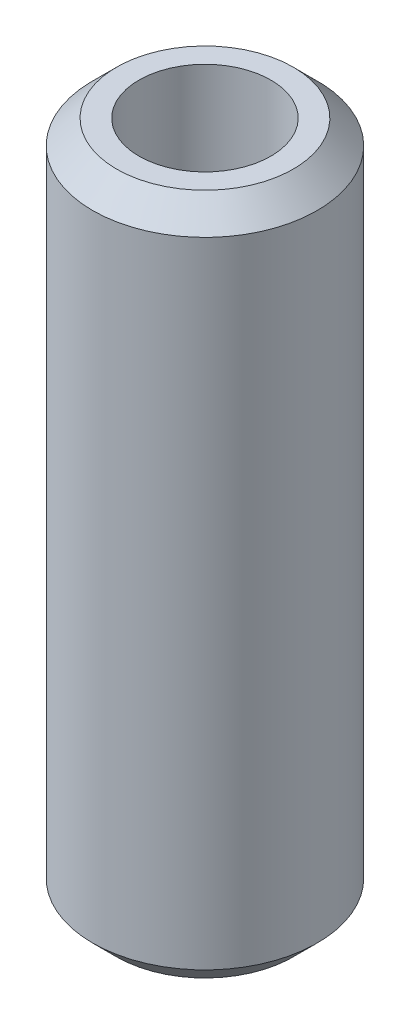
ISO-10303-21;
HEADER;
FILE_DESCRIPTION(('STEP AP214'),'2;1');
FILE_NAME('part.step','',(''),(''),'','','');
FILE_SCHEMA(('AUTOMOTIVE_DESIGN { 1 0 10303 214 1 1 1 1 }'));
ENDSEC;
DATA;
#1=APPLICATION_CONTEXT('core data for automotive mechanical design processes');
#2=APPLICATION_PROTOCOL_DEFINITION('international standard','automotive_design',2000,#1);
#3=PRODUCT_CONTEXT('',#1,'mechanical');
#4=PRODUCT('Part','Part','',(#3));
#5=PRODUCT_RELATED_PRODUCT_CATEGORY('part','',(#4));
#6=PRODUCT_DEFINITION_FORMATION('','',#4);
#7=PRODUCT_DEFINITION_CONTEXT('part definition',#1,'design');
#8=PRODUCT_DEFINITION('design','',#6,#7);
#9=PRODUCT_DEFINITION_SHAPE('','',#8);
#10=(LENGTH_UNIT() NAMED_UNIT(*) SI_UNIT(.MILLI.,.METRE.));
#11=(NAMED_UNIT(*) PLANE_ANGLE_UNIT() SI_UNIT($,.RADIAN.));
#12=(NAMED_UNIT(*) SI_UNIT($,.STERADIAN.) SOLID_ANGLE_UNIT());
#13=UNCERTAINTY_MEASURE_WITH_UNIT(LENGTH_MEASURE(1.E-05),#10,'distance_accuracy_value','');
#14=(GEOMETRIC_REPRESENTATION_CONTEXT(3) GLOBAL_UNCERTAINTY_ASSIGNED_CONTEXT((#13)) GLOBAL_UNIT_ASSIGNED_CONTEXT((#10,
#11,#12)) REPRESENTATION_CONTEXT('',''));
#15=CARTESIAN_POINT('',(0.,0.,0.));
#16=DIRECTION('',(0.,0.,1.));
#17=DIRECTION('',(1.,0.,0.));
#18=AXIS2_PLACEMENT_3D('',#15,#16,#17);
#19=CARTESIAN_POINT('',(0.,45.5729119586695,0.));
#20=DIRECTION('',(0.,-1.,0.));
#21=DIRECTION('',(0.,0.,-1.));
#22=AXIS2_PLACEMENT_3D('',#19,#20,#21);
#23=CYLINDRICAL_SURFACE('',#22,7.5);
#24=CARTESIAN_POINT('',(0.,43.9753235145406,0.));
#25=DIRECTION('',(0.,1.,0.));
#26=DIRECTION('',(0.,0.,1.));
#27=AXIS2_PLACEMENT_3D('',#24,#25,#26);
#28=CIRCLE('',#27,7.5);
#29=CARTESIAN_POINT('',(0.,43.9753235145406,7.5));
#30=VERTEX_POINT('',#29);
#31=EDGE_CURVE('E50',#30,#30,#28,.F.);
#32=ORIENTED_EDGE('',*,*,#31,.T.);
#33=EDGE_LOOP('',(#32));
#34=FACE_BOUND('',#33,.T.);
#35=CARTESIAN_POINT('',(0.,1.59758844412891,0.));
#36=DIRECTION('',(0.,1.,0.));
#37=DIRECTION('',(0.,0.,1.));
#38=AXIS2_PLACEMENT_3D('',#35,#36,#37);
#39=CIRCLE('',#38,7.5);
#40=CARTESIAN_POINT('',(0.,1.59758844412891,7.5));
#41=VERTEX_POINT('',#40);
#42=EDGE_CURVE('E51',#41,#41,#39,.T.);
#43=ORIENTED_EDGE('',*,*,#42,.T.);
#44=EDGE_LOOP('',(#43));
#45=FACE_BOUND('',#44,.T.);
#46=ADVANCED_FACE('F39',(#34,#45),#23,.T.);
#47=CARTESIAN_POINT('',(0.,45.5729119586695,0.));
#48=DIRECTION('',(0.,1.,0.));
#49=DIRECTION('',(0.,0.,1.));
#50=AXIS2_PLACEMENT_3D('',#47,#48,#49);
#51=PLANE('',#50);
#52=CARTESIAN_POINT('',(0.,45.5729119586695,0.));
#53=DIRECTION('',(0.,1.,0.));
#54=DIRECTION('',(0.,0.,1.));
#55=AXIS2_PLACEMENT_3D('',#52,#53,#54);
#56=CIRCLE('',#55,5.90241155587108);
#57=CARTESIAN_POINT('',(0.,45.5729119586695,5.90241155587108));
#58=VERTEX_POINT('',#57);
#59=EDGE_CURVE('E54',#58,#58,#56,.T.);
#60=ORIENTED_EDGE('',*,*,#59,.T.);
#61=EDGE_LOOP('',(#60));
#62=FACE_BOUND('',#61,.T.);
#63=CARTESIAN_POINT('',(0.,45.5729119586695,0.));
#64=DIRECTION('',(0.,1.,0.));
#65=DIRECTION('',(0.,0.,1.));
#66=AXIS2_PLACEMENT_3D('',#63,#64,#65);
#67=CIRCLE('',#66,4.40613808106436);
#68=CARTESIAN_POINT('',(0.,45.5729119586695,4.40613808106436));
#69=VERTEX_POINT('',#68);
#70=EDGE_CURVE('E58',#69,#69,#67,.T.);
#71=ORIENTED_EDGE('',*,*,#70,.F.);
#72=EDGE_LOOP('',(#71));
#73=FACE_BOUND('',#72,.T.);
#74=ADVANCED_FACE('F69',(#62,#73),#51,.T.);
#75=CARTESIAN_POINT('',(0.,0.,0.));
#76=DIRECTION('',(0.,1.,0.));
#77=DIRECTION('',(0.,0.,1.));
#78=AXIS2_PLACEMENT_3D('',#75,#76,#77);
#79=PLANE('',#78);
#80=CARTESIAN_POINT('',(0.,0.,0.));
#81=DIRECTION('',(0.,1.,0.));
#82=DIRECTION('',(0.,0.,1.));
#83=AXIS2_PLACEMENT_3D('',#80,#81,#82);
#84=CIRCLE('',#83,5.90241155587108);
#85=CARTESIAN_POINT('',(0.,0.,5.90241155587108));
#86=VERTEX_POINT('',#85);
#87=EDGE_CURVE('E10',#86,#86,#84,.F.);
#88=ORIENTED_EDGE('',*,*,#87,.T.);
#89=EDGE_LOOP('',(#88));
#90=FACE_BOUND('',#89,.T.);
#91=CARTESIAN_POINT('',(0.,0.,0.));
#92=DIRECTION('',(0.,1.,0.));
#93=DIRECTION('',(0.,0.,1.));
#94=AXIS2_PLACEMENT_3D('',#91,#92,#93);
#95=CIRCLE('',#94,4.40613808106436);
#96=CARTESIAN_POINT('',(0.,0.,4.40613808106436));
#97=VERTEX_POINT('',#96);
#98=EDGE_CURVE('E63',#97,#97,#95,.T.);
#99=ORIENTED_EDGE('',*,*,#98,.T.);
#100=EDGE_LOOP('',(#99));
#101=FACE_BOUND('',#100,.T.);
#102=ADVANCED_FACE('F75',(#90,#101),#79,.F.);
#103=CARTESIAN_POINT('',(0.,45.5729119586695,0.));
#104=DIRECTION('',(0.,-1.,0.));
#105=DIRECTION('',(0.,0.,-1.));
#106=AXIS2_PLACEMENT_3D('',#103,#104,#105);
#107=CYLINDRICAL_SURFACE('',#106,4.40613808106436);
#108=ORIENTED_EDGE('',*,*,#70,.T.);
#109=EDGE_LOOP('',(#108));
#110=FACE_BOUND('',#109,.T.);
#111=ORIENTED_EDGE('',*,*,#98,.F.);
#112=EDGE_LOOP('',(#111));
#113=FACE_BOUND('',#112,.T.);
#114=ADVANCED_FACE('F70',(#110,#113),#107,.F.);
#115=CARTESIAN_POINT('',(0.,45.5729119586695,0.));
#116=DIRECTION('',(0.,-1.,0.));
#117=DIRECTION('',(0.,0.,-1.));
#118=AXIS2_PLACEMENT_3D('',#115,#116,#117);
#119=CONICAL_SURFACE('',#118,5.90241155587108,0.785398163397446);
#120=ORIENTED_EDGE('',*,*,#31,.F.);
#121=EDGE_LOOP('',(#120));
#122=FACE_BOUND('',#121,.T.);
#123=ORIENTED_EDGE('',*,*,#59,.F.);
#124=EDGE_LOOP('',(#123));
#125=FACE_BOUND('',#124,.T.);
#126=ADVANCED_FACE('F81',(#122,#125),#119,.T.);
#127=CARTESIAN_POINT('',(0.,1.59758844412891,0.));
#128=DIRECTION('',(0.,1.,0.));
#129=DIRECTION('',(0.,0.,1.));
#130=AXIS2_PLACEMENT_3D('',#127,#128,#129);
#131=CONICAL_SURFACE('',#130,7.5,0.785398163397452);
#132=ORIENTED_EDGE('',*,*,#87,.F.);
#133=EDGE_LOOP('',(#132));
#134=FACE_BOUND('',#133,.T.);
#135=ORIENTED_EDGE('',*,*,#42,.F.);
#136=EDGE_LOOP('',(#135));
#137=FACE_BOUND('',#136,.T.);
#138=ADVANCED_FACE('F45',(#134,#137),#131,.T.);
#139=CLOSED_SHELL('',(#46,#74,#102,#114,#126,#138));
#140=MANIFOLD_SOLID_BREP('B2',#139);
#141=ADVANCED_BREP_SHAPE_REPRESENTATION('',(#18,#140),#14);
#142=SHAPE_DEFINITION_REPRESENTATION(#9,#141);
ENDSEC;
END-ISO-10303-21;
